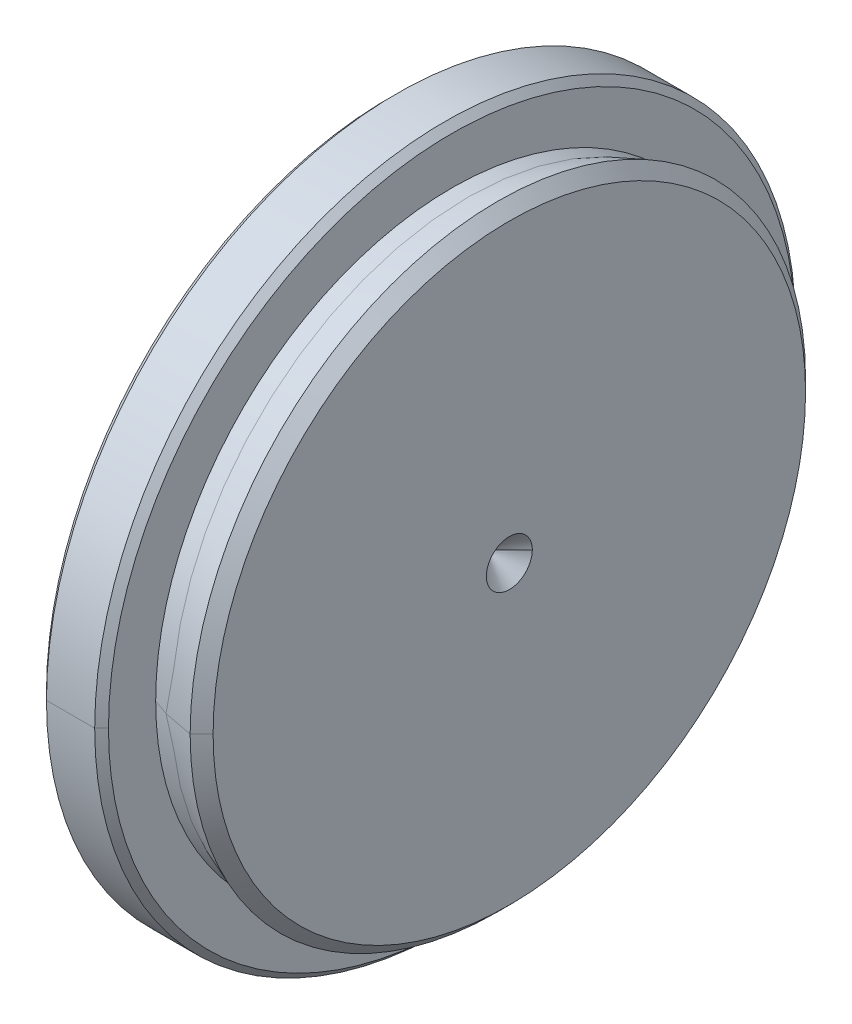
ISO-10303-21;
HEADER;
FILE_DESCRIPTION(('STEP AP214'),'2;1');
FILE_NAME('part.step','',(''),(''),'','','');
FILE_SCHEMA(('AUTOMOTIVE_DESIGN { 1 0 10303 214 1 1 1 1 }'));
ENDSEC;
DATA;
#1=APPLICATION_CONTEXT('core data for automotive mechanical design processes');
#2=APPLICATION_PROTOCOL_DEFINITION('international standard','automotive_design',2000,#1);
#3=PRODUCT_CONTEXT('',#1,'mechanical');
#4=PRODUCT('Part','Part','',(#3));
#5=PRODUCT_RELATED_PRODUCT_CATEGORY('part','',(#4));
#6=PRODUCT_DEFINITION_FORMATION('','',#4);
#7=PRODUCT_DEFINITION_CONTEXT('part definition',#1,'design');
#8=PRODUCT_DEFINITION('design','',#6,#7);
#9=PRODUCT_DEFINITION_SHAPE('','',#8);
#10=(LENGTH_UNIT() NAMED_UNIT(*) SI_UNIT(.MILLI.,.METRE.));
#11=(NAMED_UNIT(*) PLANE_ANGLE_UNIT() SI_UNIT($,.RADIAN.));
#12=(NAMED_UNIT(*) SI_UNIT($,.STERADIAN.) SOLID_ANGLE_UNIT());
#13=UNCERTAINTY_MEASURE_WITH_UNIT(LENGTH_MEASURE(1.E-05),#10,'distance_accuracy_value','');
#14=(GEOMETRIC_REPRESENTATION_CONTEXT(3) GLOBAL_UNCERTAINTY_ASSIGNED_CONTEXT((#13)) GLOBAL_UNIT_ASSIGNED_CONTEXT((#10,
#11,#12)) REPRESENTATION_CONTEXT('',''));
#15=CARTESIAN_POINT('',(0.,0.,0.));
#16=DIRECTION('',(0.,0.,1.));
#17=DIRECTION('',(1.,0.,0.));
#18=AXIS2_PLACEMENT_3D('',#15,#16,#17);
#19=CARTESIAN_POINT('',(2.7,0.,0.));
#20=DIRECTION('',(1.,0.,0.));
#21=DIRECTION('',(0.,0.,-1.));
#22=AXIS2_PLACEMENT_3D('',#19,#20,#21);
#23=CYLINDRICAL_SURFACE('',#22,13.395);
#24=CARTESIAN_POINT('',(4.7,0.,-13.395));
#25=DIRECTION('',(-1.,0.,0.));
#26=VECTOR('',#25,1.);
#27=LINE('',#24,#26);
#28=CARTESIAN_POINT('',(4.7,0.,-13.395));
#29=VERTEX_POINT('',#28);
#30=CARTESIAN_POINT('',(3.4,0.,-13.145));
#31=VERTEX_POINT('',#30);
#32=EDGE_CURVE('E98',#29,#31,#27,.T.);
#33=ORIENTED_EDGE('',*,*,#32,.F.);
#34=CARTESIAN_POINT('',(4.7,0.,0.));
#35=DIRECTION('',(1.,0.,0.));
#36=DIRECTION('',(0.,0.,1.));
#37=AXIS2_PLACEMENT_3D('',#34,#35,#36);
#38=CIRCLE('',#37,13.395);
#39=CARTESIAN_POINT('',(4.7,0.,13.395));
#40=VERTEX_POINT('',#39);
#41=EDGE_CURVE('E119',#40,#29,#38,.T.);
#42=ORIENTED_EDGE('',*,*,#41,.F.);
#43=CARTESIAN_POINT('',(3.4,0.,13.395));
#44=DIRECTION('',(1.,0.,0.));
#45=VECTOR('',#44,1.);
#46=LINE('',#43,#45);
#47=CARTESIAN_POINT('',(3.4,0.,13.145));
#48=VERTEX_POINT('',#47);
#49=EDGE_CURVE('E101',#48,#40,#46,.T.);
#50=ORIENTED_EDGE('',*,*,#49,.F.);
#51=CARTESIAN_POINT('',(3.4,0.,0.));
#52=DIRECTION('',(-1.,0.,0.));
#53=DIRECTION('',(0.,0.,-1.));
#54=AXIS2_PLACEMENT_3D('',#51,#52,#53);
#55=CIRCLE('',#54,12.895);
#56=EDGE_CURVE('E96',#31,#48,#55,.T.);
#57=ORIENTED_EDGE('',*,*,#56,.F.);
#58=EDGE_LOOP('',(#33,#42,#50,#57));
#59=FACE_BOUND('',#58,.T.);
#60=ADVANCED_FACE('F15',(#59),#23,.T.);
#61=CARTESIAN_POINT('',(2.7,0.,0.));
#62=DIRECTION('',(1.,0.,0.));
#63=DIRECTION('',(0.,0.,-1.));
#64=AXIS2_PLACEMENT_3D('',#61,#62,#63);
#65=CYLINDRICAL_SURFACE('',#64,13.395);
#66=CARTESIAN_POINT('',(4.7,0.,0.));
#67=DIRECTION('',(1.,0.,0.));
#68=DIRECTION('',(0.,0.,-1.));
#69=AXIS2_PLACEMENT_3D('',#66,#67,#68);
#70=CIRCLE('',#69,13.395);
#71=EDGE_CURVE('E115',#29,#40,#70,.T.);
#72=ORIENTED_EDGE('',*,*,#71,.F.);
#73=ORIENTED_EDGE('',*,*,#32,.T.);
#74=CARTESIAN_POINT('',(3.4,0.,0.));
#75=DIRECTION('',(-1.,0.,0.));
#76=DIRECTION('',(0.,0.,1.));
#77=AXIS2_PLACEMENT_3D('',#74,#75,#76);
#78=CIRCLE('',#77,12.895);
#79=EDGE_CURVE('E90',#48,#31,#78,.T.);
#80=ORIENTED_EDGE('',*,*,#79,.F.);
#81=ORIENTED_EDGE('',*,*,#49,.T.);
#82=EDGE_LOOP('',(#72,#73,#80,#81));
#83=FACE_BOUND('',#82,.T.);
#84=ADVANCED_FACE('F113',(#83),#65,.T.);
#85=CARTESIAN_POINT('',(5.2,0.,0.));
#86=DIRECTION('',(-1.,0.,0.));
#87=DIRECTION('',(0.,0.,1.));
#88=AXIS2_PLACEMENT_3D('',#85,#86,#87);
#89=CONICAL_SURFACE('',#88,12.895,0.785398163397448);
#90=CARTESIAN_POINT('',(4.7,0.,13.395));
#91=DIRECTION('',(0.707106781186549,0.,-0.707106781186546));
#92=VECTOR('',#91,1.);
#93=LINE('',#90,#92);
#94=CARTESIAN_POINT('',(5.2,0.,12.895));
#95=VERTEX_POINT('',#94);
#96=EDGE_CURVE('E575',#40,#95,#93,.T.);
#97=ORIENTED_EDGE('',*,*,#96,.F.);
#98=ORIENTED_EDGE('',*,*,#41,.T.);
#99=CARTESIAN_POINT('',(5.2,0.,-12.895));
#100=DIRECTION('',(-0.707106781186549,0.,-0.707106781186546));
#101=VECTOR('',#100,1.);
#102=LINE('',#99,#101);
#103=CARTESIAN_POINT('',(5.2,0.,-12.895));
#104=VERTEX_POINT('',#103);
#105=EDGE_CURVE('E595',#104,#29,#102,.T.);
#106=ORIENTED_EDGE('',*,*,#105,.F.);
#107=CARTESIAN_POINT('',(5.2,0.,12.895));
#108=CARTESIAN_POINT('',(5.2,-1.26976891908479,12.895));
#109=CARTESIAN_POINT('',(5.2,-2.51568970239797,12.6472261907996));
#110=CARTESIAN_POINT('',(5.2,-3.76080388785364,12.3996127881246));
#111=CARTESIAN_POINT('',(5.2,-4.93470286034783,11.913426571733));
#112=CARTESIAN_POINT('',(5.2,-6.10758554740362,11.4276612637703));
#113=CARTESIAN_POINT('',(5.2,-7.16407815478777,10.7218006506413));
#114=CARTESIAN_POINT('',(5.2,-8.21965611953233,10.0165511257584));
#115=CARTESIAN_POINT('',(5.2,-9.11814194340053,9.11814194340053));
#116=CARTESIAN_POINT('',(5.2,-10.0158499166245,8.22051054533564));
#117=CARTESIAN_POINT('',(5.2,-10.7218006506413,7.16407815478777));
#118=CARTESIAN_POINT('',(5.2,-11.4271402183842,6.10856035475829));
#119=CARTESIAN_POINT('',(5.2,-11.913426571733,4.93470286034784));
#120=CARTESIAN_POINT('',(5.2,-12.3992919299621,3.76186161546421));
#121=CARTESIAN_POINT('',(5.2,-12.6472261907996,2.51568970239798));
#122=CARTESIAN_POINT('',(5.2,-12.8949458062682,1.27059664398139));
#123=CARTESIAN_POINT('',(5.2,-12.895,0.));
#124=CARTESIAN_POINT('',(5.2,-12.8950541468143,-1.26949664398346));
#125=CARTESIAN_POINT('',(5.2,-12.6472261907996,-2.51568970239797));
#126=CARTESIAN_POINT('',(5.2,-12.3996127881226,-3.76080388785424));
#127=CARTESIAN_POINT('',(5.2,-11.913426571733,-4.93470286034784));
#128=CARTESIAN_POINT('',(5.2,-11.427661263775,-6.10758554739638));
#129=CARTESIAN_POINT('',(5.2,-10.7218006506413,-7.16407815478776));
#130=CARTESIAN_POINT('',(5.2,-10.0165511257546,-8.21965611953812));
#131=CARTESIAN_POINT('',(5.2,-9.11814194340053,-9.11814194340053));
#132=CARTESIAN_POINT('',(5.2,-8.22051054532757,-10.0158499166306));
#133=CARTESIAN_POINT('',(5.2,-7.16407815478777,-10.7218006506413));
#134=CARTESIAN_POINT('',(5.2,-6.10856035475402,-11.4271402183864));
#135=CARTESIAN_POINT('',(5.2,-4.93470286034784,-11.913426571733));
#136=CARTESIAN_POINT('',(5.2,-3.76186161546228,-12.3992919299625));
#137=CARTESIAN_POINT('',(5.2,-2.51568970239798,-12.6472261907996));
#138=CARTESIAN_POINT('',(5.2,-1.27032425441264,-12.895));
#139=CARTESIAN_POINT('',(5.2,0.,-12.895));
#140=B_SPLINE_CURVE_WITH_KNOTS('',2,(#107,#108,#109,#110,#111,#112,#113,#114,#115,#116,#117,
#118,#119,#120,#121,#122,#123,#124,#125,#126,#127,#128,#129,#130,#131,#132,#133,#134,#135,#136,
#137,#138,#139),.UNSPECIFIED.,.F.,.F.,(3,2,2,2,2,2,2,2,2,2,2,2,2,2,2,2,3),(0.,0.0625,0.125,
0.1875,0.25,0.3125,0.375,0.4375,0.5,0.5625,0.625,0.6875,0.75,0.8125,0.875,0.9375,1.),.UNSPECIFIED.);
#141=EDGE_CURVE('E544',#95,#104,#140,.T.);
#142=ORIENTED_EDGE('',*,*,#141,.F.);
#143=EDGE_LOOP('',(#97,#98,#106,#142));
#144=FACE_BOUND('',#143,.T.);
#145=ADVANCED_FACE('F709',(#144),#89,.T.);
#146=CARTESIAN_POINT('',(5.2,0.,0.));
#147=DIRECTION('',(-1.,0.,0.));
#148=DIRECTION('',(0.,0.,1.));
#149=AXIS2_PLACEMENT_3D('',#146,#147,#148);
#150=CONICAL_SURFACE('',#149,12.895,0.785398163397448);
#151=ORIENTED_EDGE('',*,*,#71,.T.);
#152=ORIENTED_EDGE('',*,*,#96,.T.);
#153=CARTESIAN_POINT('',(5.2,0.,-12.895));
#154=CARTESIAN_POINT('',(5.2,1.26976891908395,-12.895));
#155=CARTESIAN_POINT('',(5.2,2.51568970239797,-12.6472261907996));
#156=CARTESIAN_POINT('',(5.2,3.76080388786245,-12.399612788123));
#157=CARTESIAN_POINT('',(5.2,4.93470286034783,-11.913426571733));
#158=CARTESIAN_POINT('',(5.2,6.10758554741158,-11.4276612637649));
#159=CARTESIAN_POINT('',(5.2,7.16407815478777,-10.7218006506413));
#160=CARTESIAN_POINT('',(5.2,8.21965611952618,-10.0165511257625));
#161=CARTESIAN_POINT('',(5.2,9.11814194340053,-9.11814194340053));
#162=CARTESIAN_POINT('',(5.2,10.0158499166203,-8.22051054534181));
#163=CARTESIAN_POINT('',(5.2,10.7218006506413,-7.16407815478777));
#164=CARTESIAN_POINT('',(5.2,11.427140218385,-6.10856035475718));
#165=CARTESIAN_POINT('',(5.2,11.913426571733,-4.93470286034783));
#166=CARTESIAN_POINT('',(5.2,12.3992919299642,-3.7618616154583));
#167=CARTESIAN_POINT('',(5.2,12.6472261907996,-2.51568970239797));
#168=CARTESIAN_POINT('',(5.2,12.8949458062682,-1.27059664397669));
#169=CARTESIAN_POINT('',(5.2,12.895,0.));
#170=CARTESIAN_POINT('',(5.2,12.8950541468143,1.26949664397922));
#171=CARTESIAN_POINT('',(5.2,12.6472261907996,2.51568970239797));
#172=CARTESIAN_POINT('',(5.2,12.3996127881223,3.76080388786001));
#173=CARTESIAN_POINT('',(5.2,11.913426571733,4.93470286034783));
#174=CARTESIAN_POINT('',(5.2,11.4276612637661,6.10758554741282));
#175=CARTESIAN_POINT('',(5.2,10.7218006506413,7.16407815478777));
#176=CARTESIAN_POINT('',(5.2,10.0165511257523,8.21965611953838));
#177=CARTESIAN_POINT('',(5.2,9.11814194340053,9.11814194340053));
#178=CARTESIAN_POINT('',(5.2,8.22051054533392,10.0158499166262));
#179=CARTESIAN_POINT('',(5.2,7.16407815478777,10.7218006506413));
#180=CARTESIAN_POINT('',(5.2,6.10856035476298,11.4271402183805));
#181=CARTESIAN_POINT('',(5.2,4.93470286034783,11.913426571733));
#182=CARTESIAN_POINT('',(5.2,3.76186161548225,12.3992919299564));
#183=CARTESIAN_POINT('',(5.2,2.51568970239798,12.6472261907996));
#184=CARTESIAN_POINT('',(5.2,1.27032425442335,12.895));
#185=CARTESIAN_POINT('',(5.2,0.,12.895));
#186=B_SPLINE_CURVE_WITH_KNOTS('',2,(#153,#154,#155,#156,#157,#158,#159,#160,#161,#162,#163,
#164,#165,#166,#167,#168,#169,#170,#171,#172,#173,#174,#175,#176,#177,#178,#179,#180,#181,#182,
#183,#184,#185),.UNSPECIFIED.,.F.,.F.,(3,2,2,2,2,2,2,2,2,2,2,2,2,2,2,2,3),(0.,0.0625,0.125,
0.1875,0.25,0.3125,0.375,0.4375,0.5,0.5625,0.625,0.6875,0.75,0.8125,0.875,0.9375,1.),.UNSPECIFIED.);
#187=EDGE_CURVE('E533',#104,#95,#186,.T.);
#188=ORIENTED_EDGE('',*,*,#187,.F.);
#189=ORIENTED_EDGE('',*,*,#105,.T.);
#190=EDGE_LOOP('',(#151,#152,#188,#189));
#191=FACE_BOUND('',#190,.T.);
#192=ADVANCED_FACE('F697',(#191),#150,.T.);
#193=CARTESIAN_POINT('',(5.2,0.,0.));
#194=DIRECTION('',(1.,0.,0.));
#195=DIRECTION('',(0.,0.,-1.));
#196=AXIS2_PLACEMENT_3D('',#193,#194,#195);
#197=CONICAL_SURFACE('',#196,1.,0.78539816339745);
#198=CARTESIAN_POINT('',(5.2,0.,-1.));
#199=DIRECTION('',(-0.707106781186546,0.,0.707106781186549));
#200=VECTOR('',#199,1.);
#201=LINE('',#198,#200);
#202=CARTESIAN_POINT('',(5.2,0.,-1.));
#203=VERTEX_POINT('',#202);
#204=CARTESIAN_POINT('',(4.2,0.,0.));
#205=VERTEX_POINT('',#204);
#206=EDGE_CURVE('E565',#203,#205,#201,.T.);
#207=ORIENTED_EDGE('',*,*,#206,.F.);
#208=CARTESIAN_POINT('',(5.2,0.,1.));
#209=CARTESIAN_POINT('',(5.2,0.198626106562923,1.));
#210=CARTESIAN_POINT('',(5.2,0.38268343236509,0.923879532511287));
#211=CARTESIAN_POINT('',(5.2,0.565988058606248,0.848070358486243));
#212=CARTESIAN_POINT('',(5.2,0.707106781186548,0.707106781186548));
#213=CARTESIAN_POINT('',(5.2,0.847447258664745,0.566920593389836));
#214=CARTESIAN_POINT('',(5.2,0.923879532511287,0.382683432365091));
#215=CARTESIAN_POINT('',(5.2,0.999890295720027,0.19946230709778));
#216=CARTESIAN_POINT('',(5.2,1.,0.));
#217=CARTESIAN_POINT('',(5.2,1.00010909928003,-0.198362307319598));
#218=CARTESIAN_POINT('',(5.2,0.923879532511287,-0.38268343236509));
#219=CARTESIAN_POINT('',(5.2,0.848070358486183,-0.565988058606326));
#220=CARTESIAN_POINT('',(5.2,0.707106781186548,-0.707106781186547));
#221=CARTESIAN_POINT('',(5.2,0.566920593389803,-0.847447258664759));
#222=CARTESIAN_POINT('',(5.2,0.382683432365091,-0.923879532511287));
#223=CARTESIAN_POINT('',(5.2,0.199197869000137,-1.));
#224=CARTESIAN_POINT('',(5.2,0.,-1.));
#225=B_SPLINE_CURVE_WITH_KNOTS('',2,(#208,#209,#210,#211,#212,#213,#214,#215,#216,#217,#218,
#219,#220,#221,#222,#223,#224),.UNSPECIFIED.,.F.,.F.,(3,2,2,2,2,2,2,2,3),(0.,0.125,0.25,0.375,
0.5,0.625,0.75,0.875,1.),.UNSPECIFIED.);
#226=CARTESIAN_POINT('',(5.2,0.,1.));
#227=VERTEX_POINT('',#226);
#228=EDGE_CURVE('E519',#227,#203,#225,.T.);
#229=ORIENTED_EDGE('',*,*,#228,.F.);
#230=CARTESIAN_POINT('',(4.2,0.,0.));
#231=DIRECTION('',(0.707106781186546,0.,0.707106781186549));
#232=VECTOR('',#231,1.);
#233=LINE('',#230,#232);
#234=EDGE_CURVE('E555',#205,#227,#233,.T.);
#235=ORIENTED_EDGE('',*,*,#234,.F.);
#236=EDGE_LOOP('',(#207,#229,#235));
#237=FACE_BOUND('',#236,.T.);
#238=ADVANCED_FACE('F685',(#237),#197,.F.);
#239=CARTESIAN_POINT('',(5.2,0.,0.));
#240=DIRECTION('',(1.,0.,0.));
#241=DIRECTION('',(0.,1.,0.));
#242=AXIS2_PLACEMENT_3D('',#239,#240,#241);
#243=PLANE('',#242);
#244=ORIENTED_EDGE('',*,*,#228,.T.);
#245=CARTESIAN_POINT('',(5.2,0.,-1.));
#246=CARTESIAN_POINT('',(5.2,-0.198626106562955,-1.));
#247=CARTESIAN_POINT('',(5.2,-0.38268343236509,-0.923879532511287));
#248=CARTESIAN_POINT('',(5.2,-0.56598805860627,-0.84807035848622));
#249=CARTESIAN_POINT('',(5.2,-0.707106781186548,-0.707106781186548));
#250=CARTESIAN_POINT('',(5.2,-0.847447258664762,-0.566920593389819));
#251=CARTESIAN_POINT('',(5.2,-0.923879532511287,-0.38268343236509));
#252=CARTESIAN_POINT('',(5.2,-0.999890295720027,-0.199462307097756));
#253=CARTESIAN_POINT('',(5.2,-1.,0.));
#254=CARTESIAN_POINT('',(5.2,-1.00010909928003,0.198362307319566));
#255=CARTESIAN_POINT('',(5.2,-0.923879532511287,0.38268343236509));
#256=CARTESIAN_POINT('',(5.2,-0.84807035848622,0.565988058606271));
#257=CARTESIAN_POINT('',(5.2,-0.707106781186548,0.707106781186548));
#258=CARTESIAN_POINT('',(5.2,-0.566920593389862,0.847447258664719));
#259=CARTESIAN_POINT('',(5.2,-0.38268343236509,0.923879532511287));
#260=CARTESIAN_POINT('',(5.2,-0.199197869000174,1.));
#261=CARTESIAN_POINT('',(5.2,0.,1.));
#262=B_SPLINE_CURVE_WITH_KNOTS('',2,(#245,#246,#247,#248,#249,#250,#251,#252,#253,#254,#255,
#256,#257,#258,#259,#260,#261),.UNSPECIFIED.,.F.,.F.,(3,2,2,2,2,2,2,2,3),(0.,0.125,0.25,0.375,
0.5,0.625,0.75,0.875,1.),.UNSPECIFIED.);
#263=EDGE_CURVE('E482',#203,#227,#262,.T.);
#264=ORIENTED_EDGE('',*,*,#263,.T.);
#265=EDGE_LOOP('',(#244,#264));
#266=FACE_BOUND('',#265,.T.);
#267=ORIENTED_EDGE('',*,*,#141,.T.);
#268=ORIENTED_EDGE('',*,*,#187,.T.);
#269=EDGE_LOOP('',(#267,#268));
#270=FACE_BOUND('',#269,.T.);
#271=ADVANCED_FACE('F673',(#266,#270),#243,.T.);
#272=CARTESIAN_POINT('',(5.2,0.,0.));
#273=DIRECTION('',(1.,0.,0.));
#274=DIRECTION('',(0.,0.,-1.));
#275=AXIS2_PLACEMENT_3D('',#272,#273,#274);
#276=CONICAL_SURFACE('',#275,1.,0.78539816339745);
#277=ORIENTED_EDGE('',*,*,#234,.T.);
#278=ORIENTED_EDGE('',*,*,#263,.F.);
#279=ORIENTED_EDGE('',*,*,#206,.T.);
#280=EDGE_LOOP('',(#277,#278,#279));
#281=FACE_BOUND('',#280,.T.);
#282=ADVANCED_FACE('F657',(#281),#276,.F.);
#283=CARTESIAN_POINT('',(2.7,0.,0.));
#284=DIRECTION('',(-1.,0.,0.));
#285=DIRECTION('',(0.,0.,1.));
#286=AXIS2_PLACEMENT_3D('',#283,#284,#285);
#287=CONICAL_SURFACE('',#286,14.95,0.785398163397446);
#288=CARTESIAN_POINT('',(2.7,0.,14.95));
#289=DIRECTION('',(-0.707106781186549,0.,0.707106781186546));
#290=VECTOR('',#289,1.);
#291=LINE('',#288,#290);
#292=CARTESIAN_POINT('',(2.7,0.,14.95));
#293=VERTEX_POINT('',#292);
#294=CARTESIAN_POINT('',(2.4,0.,15.25));
#295=VERTEX_POINT('',#294);
#296=EDGE_CURVE('E108',#293,#295,#291,.T.);
#297=ORIENTED_EDGE('',*,*,#296,.T.);
#298=CARTESIAN_POINT('',(2.4,0.,0.));
#299=DIRECTION('',(-1.,0.,0.));
#300=DIRECTION('',(0.,0.,-1.));
#301=AXIS2_PLACEMENT_3D('',#298,#299,#300);
#302=CIRCLE('',#301,15.25);
#303=CARTESIAN_POINT('',(2.4,0.,-15.25));
#304=VERTEX_POINT('',#303);
#305=EDGE_CURVE('E245',#304,#295,#302,.T.);
#306=ORIENTED_EDGE('',*,*,#305,.F.);
#307=CARTESIAN_POINT('',(2.39999999999999,0.,-15.25));
#308=DIRECTION('',(0.707106781186549,0.,0.707106781186546));
#309=VECTOR('',#308,1.);
#310=LINE('',#307,#309);
#311=CARTESIAN_POINT('',(2.7,0.,-14.95));
#312=VERTEX_POINT('',#311);
#313=EDGE_CURVE('E308',#304,#312,#310,.T.);
#314=ORIENTED_EDGE('',*,*,#313,.T.);
#315=CARTESIAN_POINT('',(2.7,0.,14.95));
#316=CARTESIAN_POINT('',(2.7,-1.47216876116469,14.95));
#317=CARTESIAN_POINT('',(2.7,-2.91660031414112,14.6627399420283));
#318=CARTESIAN_POINT('',(2.7,-4.36022527837732,14.3756402936847));
#319=CARTESIAN_POINT('',(2.7,-5.72111731385809,13.8119990110437));
#320=CARTESIAN_POINT('',(2.7,-7.08099306635563,13.2487786427951));
#321=CARTESIAN_POINT('',(2.7,-8.30577498364304,12.430470703923));
#322=CARTESIAN_POINT('',(2.7,-9.52964226185981,11.6127738586687));
#323=CARTESIAN_POINT('',(2.7,-10.5712463787389,10.5712463787389));
#324=CARTESIAN_POINT('',(2.7,-11.6120726495368,9.53049668765955));
#325=CARTESIAN_POINT('',(2.7,-12.430470703923,8.30577498364305));
#326=CARTESIAN_POINT('',(2.7,-13.2482575974116,7.08196787370708));
#327=CARTESIAN_POINT('',(2.7,-13.8119990110437,5.7211173138581));
#328=CARTESIAN_POINT('',(2.7,-14.3753194355234,4.36128300598188));
#329=CARTESIAN_POINT('',(2.7,-14.6627399420283,2.91660031414112));
#330=CARTESIAN_POINT('',(2.7,-14.9499458094936,1.4729964781868));
#331=CARTESIAN_POINT('',(2.7,-14.95,0.));
#332=CARTESIAN_POINT('',(2.7,-14.9500541500381,-1.47189647819977));
#333=CARTESIAN_POINT('',(2.7,-14.6627399420283,-2.91660031414112));
#334=CARTESIAN_POINT('',(2.7,-14.3756402936798,-4.36022527839032));
#335=CARTESIAN_POINT('',(2.7,-13.8119990110437,-5.72111731385809));
#336=CARTESIAN_POINT('',(2.7,-13.2487786427913,-7.08099306636363));
#337=CARTESIAN_POINT('',(2.7,-12.430470703923,-8.30577498364304));
#338=CARTESIAN_POINT('',(2.7,-11.6127738586593,-9.52964226187148));
#339=CARTESIAN_POINT('',(2.7,-10.5712463787389,-10.5712463787389));
#340=CARTESIAN_POINT('',(2.7,-9.53049668764787,-11.6120726495461));
#341=CARTESIAN_POINT('',(2.7,-8.30577498364305,-12.430470703923));
#342=CARTESIAN_POINT('',(2.7,-7.08196787370097,-13.2482575974141));
#343=CARTESIAN_POINT('',(2.7,-5.7211173138581,-13.8119990110437));
#344=CARTESIAN_POINT('',(2.7,-4.36128300598188,-14.3753194355234));
#345=CARTESIAN_POINT('',(2.7,-2.91660031414112,-14.6627399420283));
#346=CARTESIAN_POINT('',(2.7,-1.47272409648544,-14.95));
#347=CARTESIAN_POINT('',(2.7,0.,-14.95));
#348=B_SPLINE_CURVE_WITH_KNOTS('',2,(#315,#316,#317,#318,#319,#320,#321,#322,#323,#324,#325,
#326,#327,#328,#329,#330,#331,#332,#333,#334,#335,#336,#337,#338,#339,#340,#341,#342,#343,#344,
#345,#346,#347),.UNSPECIFIED.,.F.,.F.,(3,2,2,2,2,2,2,2,2,2,2,2,2,2,2,2,3),(0.,0.0625,0.125,
0.1875,0.25,0.3125,0.375,0.4375,0.5,0.5625,0.625,0.6875,0.75,0.8125,0.875,0.9375,1.),.UNSPECIFIED.);
#349=EDGE_CURVE('E193',#293,#312,#348,.T.);
#350=ORIENTED_EDGE('',*,*,#349,.F.);
#351=EDGE_LOOP('',(#297,#306,#314,#350));
#352=FACE_BOUND('',#351,.T.);
#353=ADVANCED_FACE('F652',(#352),#287,.T.);
#354=CARTESIAN_POINT('',(3.4,0.,0.));
#355=DIRECTION('',(-1.,0.,0.));
#356=DIRECTION('',(0.,0.,1.));
#357=AXIS2_PLACEMENT_3D('',#354,#355,#356);
#358=CYLINDRICAL_SURFACE('',#357,12.895);
#359=CARTESIAN_POINT('',(2.7,0.,12.895));
#360=DIRECTION('',(1.,0.,0.));
#361=VECTOR('',#360,1.);
#362=LINE('',#359,#361);
#363=CARTESIAN_POINT('',(2.7,0.,12.895));
#364=VERTEX_POINT('',#363);
#365=EDGE_CURVE('E134',#364,#48,#362,.T.);
#366=ORIENTED_EDGE('',*,*,#365,.F.);
#367=CARTESIAN_POINT('',(2.7,0.,-12.895));
#368=CARTESIAN_POINT('',(2.7,-1.26976891908446,-12.895));
#369=CARTESIAN_POINT('',(2.7,-2.51568970239797,-12.6472261907997));
#370=CARTESIAN_POINT('',(2.7,-3.76080388786099,-12.3996127881232));
#371=CARTESIAN_POINT('',(2.7,-4.93470286034783,-11.913426571733));
#372=CARTESIAN_POINT('',(2.7,-6.10758554741783,-11.4276612637627));
#373=CARTESIAN_POINT('',(2.7,-7.16407815478777,-10.7218006506413));
#374=CARTESIAN_POINT('',(2.7,-8.21965611953825,-10.0165511257525));
#375=CARTESIAN_POINT('',(2.7,-9.11814194340053,-9.11814194340053));
#376=CARTESIAN_POINT('',(2.7,-10.0158499166304,-8.22051054532974));
#377=CARTESIAN_POINT('',(2.7,-10.7218006506413,-7.16407815478777));
#378=CARTESIAN_POINT('',(2.7,-11.4271402183872,-6.10856035475093));
#379=CARTESIAN_POINT('',(2.7,-11.913426571733,-4.93470286034783));
#380=CARTESIAN_POINT('',(2.7,-12.3992919299598,-3.76186161547));
#381=CARTESIAN_POINT('',(2.7,-12.6472261907997,-2.51568970239797));
#382=CARTESIAN_POINT('',(2.7,-12.8949458062682,-1.27059664398726));
#383=CARTESIAN_POINT('',(2.7,-12.895,0.));
#384=CARTESIAN_POINT('',(2.7,-12.8950541468144,1.26949664397922));
#385=CARTESIAN_POINT('',(2.7,-12.6472261907997,2.51568970239797));
#386=CARTESIAN_POINT('',(2.7,-12.3996127881223,3.76080388786001));
#387=CARTESIAN_POINT('',(2.7,-11.913426571733,4.93470286034783));
#388=CARTESIAN_POINT('',(2.7,-11.4276612637705,6.1075855474023));
#389=CARTESIAN_POINT('',(2.7,-10.7218006506413,7.16407815478777));
#390=CARTESIAN_POINT('',(2.7,-10.0165511257564,8.21965611953636));
#391=CARTESIAN_POINT('',(2.7,-9.11814194340053,9.11814194340053));
#392=CARTESIAN_POINT('',(2.7,-8.22051054533191,10.0158499166262));
#393=CARTESIAN_POINT('',(2.7,-7.16407815478777,10.7218006506413));
#394=CARTESIAN_POINT('',(2.7,-6.10856035476986,11.4271402183772));
#395=CARTESIAN_POINT('',(2.7,-4.93470286034784,11.913426571733));
#396=CARTESIAN_POINT('',(2.7,-3.76186161548418,12.399291929956));
#397=CARTESIAN_POINT('',(2.7,-2.51568970239798,12.6472261907997));
#398=CARTESIAN_POINT('',(2.7,-1.27032425442335,12.895));
#399=CARTESIAN_POINT('',(2.7,0.,12.895));
#400=B_SPLINE_CURVE_WITH_KNOTS('',2,(#367,#368,#369,#370,#371,#372,#373,#374,#375,#376,#377,
#378,#379,#380,#381,#382,#383,#384,#385,#386,#387,#388,#389,#390,#391,#392,#393,#394,#395,#396,
#397,#398,#399),.UNSPECIFIED.,.F.,.F.,(3,2,2,2,2,2,2,2,2,2,2,2,2,2,2,2,3),(0.,0.0625,0.125,
0.1875,0.25,0.3125,0.375,0.4375,0.5,0.5625,0.625,0.6875,0.75,0.8125,0.875,0.9375,1.),.UNSPECIFIED.);
#401=CARTESIAN_POINT('',(2.7,0.,-12.895));
#402=VERTEX_POINT('',#401);
#403=EDGE_CURVE('E127',#402,#364,#400,.T.);
#404=ORIENTED_EDGE('',*,*,#403,.F.);
#405=CARTESIAN_POINT('',(3.4,0.,-12.895));
#406=DIRECTION('',(-1.,0.,0.));
#407=VECTOR('',#406,1.);
#408=LINE('',#405,#407);
#409=EDGE_CURVE('E123',#31,#402,#408,.T.);
#410=ORIENTED_EDGE('',*,*,#409,.F.);
#411=ORIENTED_EDGE('',*,*,#56,.T.);
#412=EDGE_LOOP('',(#366,#404,#410,#411));
#413=FACE_BOUND('',#412,.T.);
#414=ADVANCED_FACE('F125',(#413),#358,.T.);
#415=CARTESIAN_POINT('',(3.4,0.,0.));
#416=DIRECTION('',(-1.,0.,0.));
#417=DIRECTION('',(0.,0.,1.));
#418=AXIS2_PLACEMENT_3D('',#415,#416,#417);
#419=CYLINDRICAL_SURFACE('',#418,12.895);
#420=CARTESIAN_POINT('',(2.7,0.,12.895));
#421=CARTESIAN_POINT('',(2.7,1.26976891908529,12.895));
#422=CARTESIAN_POINT('',(2.7,2.51568970239797,12.6472261907997));
#423=CARTESIAN_POINT('',(2.7,3.7608038878541,12.3996127881244));
#424=CARTESIAN_POINT('',(2.7,4.93470286034783,11.913426571733));
#425=CARTESIAN_POINT('',(2.7,6.1075855473931,11.4276612637746));
#426=CARTESIAN_POINT('',(2.7,7.16407815478777,10.7218006506413));
#427=CARTESIAN_POINT('',(2.7,8.21965611952429,10.0165511257664));
#428=CARTESIAN_POINT('',(2.7,9.11814194340053,9.11814194340053));
#429=CARTESIAN_POINT('',(2.7,10.0158499166305,8.22051054532961));
#430=CARTESIAN_POINT('',(2.7,10.7218006506413,7.16407815478777));
#431=CARTESIAN_POINT('',(2.7,11.4271402183833,6.10856035475666));
#432=CARTESIAN_POINT('',(2.7,11.913426571733,4.93470286034784));
#433=CARTESIAN_POINT('',(2.7,12.3992919299606,3.76186161547158));
#434=CARTESIAN_POINT('',(2.7,12.6472261907997,2.51568970239798));
#435=CARTESIAN_POINT('',(2.7,12.8949458062682,1.27059664398139));
#436=CARTESIAN_POINT('',(2.7,12.895,0.));
#437=CARTESIAN_POINT('',(2.7,12.8950541468143,-1.26949664397339));
#438=CARTESIAN_POINT('',(2.7,12.6472261907997,-2.51568970239797));
#439=CARTESIAN_POINT('',(2.7,12.3996127881246,-3.76080388785424));
#440=CARTESIAN_POINT('',(2.7,11.913426571733,-4.93470286034784));
#441=CARTESIAN_POINT('',(2.7,11.4276612637697,-6.10758554740428));
#442=CARTESIAN_POINT('',(2.7,10.7218006506413,-7.16407815478777));
#443=CARTESIAN_POINT('',(2.7,10.0165511257546,-8.21965611953812));
#444=CARTESIAN_POINT('',(2.7,9.11814194340053,-9.11814194340053));
#445=CARTESIAN_POINT('',(2.7,8.22051054532154,-10.0158499166366));
#446=CARTESIAN_POINT('',(2.7,7.16407815478777,-10.7218006506413));
#447=CARTESIAN_POINT('',(2.7,6.10856035475403,-11.4271402183844));
#448=CARTESIAN_POINT('',(2.7,4.93470286034784,-11.913426571733));
#449=CARTESIAN_POINT('',(2.7,3.76186161547112,-12.3992919299608));
#450=CARTESIAN_POINT('',(2.7,2.51568970239798,-12.6472261907997));
#451=CARTESIAN_POINT('',(2.7,1.27032425441214,-12.895));
#452=CARTESIAN_POINT('',(2.7,0.,-12.895));
#453=B_SPLINE_CURVE_WITH_KNOTS('',2,(#420,#421,#422,#423,#424,#425,#426,#427,#428,#429,#430,
#431,#432,#433,#434,#435,#436,#437,#438,#439,#440,#441,#442,#443,#444,#445,#446,#447,#448,#449,
#450,#451,#452),.UNSPECIFIED.,.F.,.F.,(3,2,2,2,2,2,2,2,2,2,2,2,2,2,2,2,3),(0.,0.0625,0.125,
0.1875,0.25,0.3125,0.375,0.4375,0.5,0.5625,0.625,0.6875,0.75,0.8125,0.875,0.9375,1.),.UNSPECIFIED.);
#454=EDGE_CURVE('E185',#364,#402,#453,.T.);
#455=ORIENTED_EDGE('',*,*,#454,.F.);
#456=ORIENTED_EDGE('',*,*,#365,.T.);
#457=ORIENTED_EDGE('',*,*,#79,.T.);
#458=ORIENTED_EDGE('',*,*,#409,.T.);
#459=EDGE_LOOP('',(#455,#456,#457,#458));
#460=FACE_BOUND('',#459,.T.);
#461=ADVANCED_FACE('F138',(#460),#419,.T.);
#462=CARTESIAN_POINT('',(5.2,0.,0.));
#463=DIRECTION('',(-1.,0.,0.));
#464=DIRECTION('',(0.,0.,1.));
#465=AXIS2_PLACEMENT_3D('',#462,#463,#464);
#466=CYLINDRICAL_SURFACE('',#465,15.25);
#467=CARTESIAN_POINT('',(2.4,0.,15.25));
#468=DIRECTION('',(-1.,0.,0.));
#469=VECTOR('',#468,1.);
#470=LINE('',#467,#469);
#471=CARTESIAN_POINT('',(0.3,0.,15.25));
#472=VERTEX_POINT('',#471);
#473=EDGE_CURVE('E256',#295,#472,#470,.T.);
#474=ORIENTED_EDGE('',*,*,#473,.T.);
#475=CARTESIAN_POINT('',(0.3,0.,0.));
#476=DIRECTION('',(-1.,0.,0.));
#477=DIRECTION('',(0.,0.,-1.));
#478=AXIS2_PLACEMENT_3D('',#475,#476,#477);
#479=CIRCLE('',#478,15.25);
#480=CARTESIAN_POINT('',(0.3,0.,-15.25));
#481=VERTEX_POINT('',#480);
#482=EDGE_CURVE('E264',#481,#472,#479,.T.);
#483=ORIENTED_EDGE('',*,*,#482,.F.);
#484=CARTESIAN_POINT('',(0.3,0.,-15.25));
#485=DIRECTION('',(1.,0.,0.));
#486=VECTOR('',#485,1.);
#487=LINE('',#484,#486);
#488=EDGE_CURVE('E233',#481,#304,#487,.T.);
#489=ORIENTED_EDGE('',*,*,#488,.T.);
#490=ORIENTED_EDGE('',*,*,#305,.T.);
#491=EDGE_LOOP('',(#474,#483,#489,#490));
#492=FACE_BOUND('',#491,.T.);
#493=ADVANCED_FACE('F159',(#492),#466,.T.);
#494=CARTESIAN_POINT('',(2.7,0.,0.));
#495=DIRECTION('',(1.,0.,0.));
#496=DIRECTION('',(0.,1.,0.));
#497=AXIS2_PLACEMENT_3D('',#494,#495,#496);
#498=PLANE('',#497);
#499=ORIENTED_EDGE('',*,*,#403,.T.);
#500=ORIENTED_EDGE('',*,*,#454,.T.);
#501=EDGE_LOOP('',(#499,#500));
#502=FACE_BOUND('',#501,.T.);
#503=ORIENTED_EDGE('',*,*,#349,.T.);
#504=CARTESIAN_POINT('',(2.7,0.,0.));
#505=DIRECTION('',(-1.,0.,0.));
#506=DIRECTION('',(0.,0.,1.));
#507=AXIS2_PLACEMENT_3D('',#504,#505,#506);
#508=CIRCLE('',#507,14.95);
#509=EDGE_CURVE('E268',#293,#312,#508,.T.);
#510=ORIENTED_EDGE('',*,*,#509,.F.);
#511=EDGE_LOOP('',(#503,#510));
#512=FACE_BOUND('',#511,.T.);
#513=ADVANCED_FACE('F190',(#502,#512),#498,.T.);
#514=CARTESIAN_POINT('',(0.3,0.,0.));
#515=DIRECTION('',(1.,0.,0.));
#516=DIRECTION('',(0.,0.,-1.));
#517=AXIS2_PLACEMENT_3D('',#514,#515,#516);
#518=CONICAL_SURFACE('',#517,15.25,0.785398163397446);
#519=CARTESIAN_POINT('',(0.,0.,-14.95));
#520=DIRECTION('',(0.70710678118655,0.,-0.707106781186545));
#521=VECTOR('',#520,1.);
#522=LINE('',#519,#521);
#523=CARTESIAN_POINT('',(0.,0.,-14.95));
#524=VERTEX_POINT('',#523);
#525=EDGE_CURVE('E269',#524,#481,#522,.T.);
#526=ORIENTED_EDGE('',*,*,#525,.T.);
#527=ORIENTED_EDGE('',*,*,#482,.T.);
#528=CARTESIAN_POINT('',(0.3,0.,15.25));
#529=DIRECTION('',(-0.70710678118655,0.,-0.707106781186545));
#530=VECTOR('',#529,1.);
#531=LINE('',#528,#530);
#532=CARTESIAN_POINT('',(0.,0.,14.95));
#533=VERTEX_POINT('',#532);
#534=EDGE_CURVE('E35',#472,#533,#531,.T.);
#535=ORIENTED_EDGE('',*,*,#534,.T.);
#536=CARTESIAN_POINT('',(0.,0.,0.));
#537=DIRECTION('',(1.,0.,0.));
#538=DIRECTION('',(0.,0.,1.));
#539=AXIS2_PLACEMENT_3D('',#536,#537,#538);
#540=CIRCLE('',#539,14.95);
#541=EDGE_CURVE('E271',#533,#524,#540,.T.);
#542=ORIENTED_EDGE('',*,*,#541,.T.);
#543=EDGE_LOOP('',(#526,#527,#535,#542));
#544=FACE_BOUND('',#543,.T.);
#545=ADVANCED_FACE('F210',(#544),#518,.T.);
#546=CARTESIAN_POINT('',(2.7,0.,0.));
#547=DIRECTION('',(-1.,0.,0.));
#548=DIRECTION('',(0.,0.,1.));
#549=AXIS2_PLACEMENT_3D('',#546,#547,#548);
#550=CONICAL_SURFACE('',#549,14.95,0.785398163397446);
#551=CARTESIAN_POINT('',(2.4,0.,0.));
#552=DIRECTION('',(-1.,0.,0.));
#553=DIRECTION('',(0.,0.,1.));
#554=AXIS2_PLACEMENT_3D('',#551,#552,#553);
#555=CIRCLE('',#554,15.25);
#556=EDGE_CURVE('E362',#295,#304,#555,.T.);
#557=ORIENTED_EDGE('',*,*,#556,.F.);
#558=ORIENTED_EDGE('',*,*,#296,.F.);
#559=ORIENTED_EDGE('',*,*,#509,.T.);
#560=ORIENTED_EDGE('',*,*,#313,.F.);
#561=EDGE_LOOP('',(#557,#558,#559,#560));
#562=FACE_BOUND('',#561,.T.);
#563=ADVANCED_FACE('F307',(#562),#550,.T.);
#564=CARTESIAN_POINT('',(0.,0.,0.));
#565=DIRECTION('',(1.,0.,0.));
#566=DIRECTION('',(0.,1.,0.));
#567=AXIS2_PLACEMENT_3D('',#564,#565,#566);
#568=PLANE('',#567);
#569=CARTESIAN_POINT('',(0.,0.,0.));
#570=DIRECTION('',(1.,0.,0.));
#571=DIRECTION('',(0.,0.,-1.));
#572=AXIS2_PLACEMENT_3D('',#569,#570,#571);
#573=CIRCLE('',#572,14.95);
#574=EDGE_CURVE('E27',#524,#533,#573,.T.);
#575=ORIENTED_EDGE('',*,*,#574,.F.);
#576=ORIENTED_EDGE('',*,*,#541,.F.);
#577=EDGE_LOOP('',(#575,#576));
#578=FACE_BOUND('',#577,.T.);
#579=ADVANCED_FACE('F329',(#578),#568,.F.);
#580=CARTESIAN_POINT('',(5.2,0.,0.));
#581=DIRECTION('',(-1.,0.,0.));
#582=DIRECTION('',(0.,0.,1.));
#583=AXIS2_PLACEMENT_3D('',#580,#581,#582);
#584=CYLINDRICAL_SURFACE('',#583,15.25);
#585=CARTESIAN_POINT('',(0.3,0.,0.));
#586=DIRECTION('',(-1.,0.,0.));
#587=DIRECTION('',(0.,0.,1.));
#588=AXIS2_PLACEMENT_3D('',#585,#586,#587);
#589=CIRCLE('',#588,15.25);
#590=EDGE_CURVE('E9',#472,#481,#589,.T.);
#591=ORIENTED_EDGE('',*,*,#590,.F.);
#592=ORIENTED_EDGE('',*,*,#473,.F.);
#593=ORIENTED_EDGE('',*,*,#556,.T.);
#594=ORIENTED_EDGE('',*,*,#488,.F.);
#595=EDGE_LOOP('',(#591,#592,#593,#594));
#596=FACE_BOUND('',#595,.T.);
#597=ADVANCED_FACE('F865',(#596),#584,.T.);
#598=CARTESIAN_POINT('',(0.3,0.,0.));
#599=DIRECTION('',(1.,0.,0.));
#600=DIRECTION('',(0.,0.,-1.));
#601=AXIS2_PLACEMENT_3D('',#598,#599,#600);
#602=CONICAL_SURFACE('',#601,15.25,0.785398163397446);
#603=ORIENTED_EDGE('',*,*,#590,.T.);
#604=ORIENTED_EDGE('',*,*,#525,.F.);
#605=ORIENTED_EDGE('',*,*,#574,.T.);
#606=ORIENTED_EDGE('',*,*,#534,.F.);
#607=EDGE_LOOP('',(#603,#604,#605,#606));
#608=FACE_BOUND('',#607,.T.);
#609=ADVANCED_FACE('F877',(#608),#602,.T.);
#610=CLOSED_SHELL('',(#60,#84,#145,#192,#238,#271,#282,#353,#414,#461,#493,#513,#545,#563,#579,
#597,#609));
#611=MANIFOLD_SOLID_BREP('B1',#610);
#612=ADVANCED_BREP_SHAPE_REPRESENTATION('',(#18,#611),#14);
#613=SHAPE_DEFINITION_REPRESENTATION(#9,#612);
ENDSEC;
END-ISO-10303-21;
